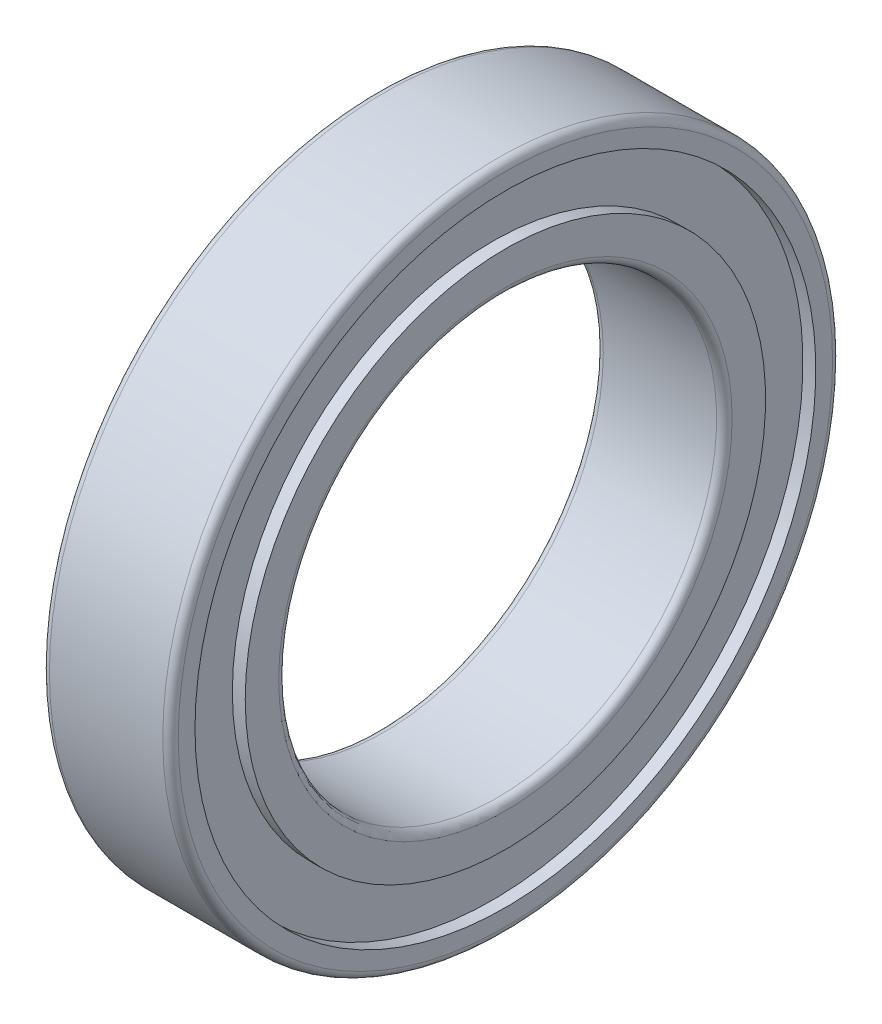
ISO-10303-21;
HEADER;
FILE_DESCRIPTION(('STEP AP214'),'2;1');
FILE_NAME('part.step','',(''),(''),'','','');
FILE_SCHEMA(('AUTOMOTIVE_DESIGN { 1 0 10303 214 1 1 1 1 }'));
ENDSEC;
DATA;
#1=APPLICATION_CONTEXT('core data for automotive mechanical design processes');
#2=APPLICATION_PROTOCOL_DEFINITION('international standard','automotive_design',2000,#1);
#3=PRODUCT_CONTEXT('',#1,'mechanical');
#4=PRODUCT('Part','Part','',(#3));
#5=PRODUCT_RELATED_PRODUCT_CATEGORY('part','',(#4));
#6=PRODUCT_DEFINITION_FORMATION('','',#4);
#7=PRODUCT_DEFINITION_CONTEXT('part definition',#1,'design');
#8=PRODUCT_DEFINITION('design','',#6,#7);
#9=PRODUCT_DEFINITION_SHAPE('','',#8);
#10=(LENGTH_UNIT() NAMED_UNIT(*) SI_UNIT(.MILLI.,.METRE.));
#11=(NAMED_UNIT(*) PLANE_ANGLE_UNIT() SI_UNIT($,.RADIAN.));
#12=(NAMED_UNIT(*) SI_UNIT($,.STERADIAN.) SOLID_ANGLE_UNIT());
#13=UNCERTAINTY_MEASURE_WITH_UNIT(LENGTH_MEASURE(1.E-05),#10,'distance_accuracy_value','');
#14=(GEOMETRIC_REPRESENTATION_CONTEXT(3) GLOBAL_UNCERTAINTY_ASSIGNED_CONTEXT((#13)) GLOBAL_UNIT_ASSIGNED_CONTEXT((#10,
#11,#12)) REPRESENTATION_CONTEXT('',''));
#15=CARTESIAN_POINT('',(0.,0.,0.));
#16=DIRECTION('',(0.,0.,1.));
#17=DIRECTION('',(1.,0.,0.));
#18=AXIS2_PLACEMENT_3D('',#15,#16,#17);
#19=CARTESIAN_POINT('',(0.,0.,0.));
#20=DIRECTION('',(-1.,0.,0.));
#21=DIRECTION('',(0.,0.,1.));
#22=AXIS2_PLACEMENT_3D('',#19,#20,#21);
#23=CYLINDRICAL_SURFACE('',#22,8.5);
#24=CARTESIAN_POINT('',(4.7,0.,0.));
#25=DIRECTION('',(-1.,0.,0.));
#26=DIRECTION('',(0.,0.,1.));
#27=AXIS2_PLACEMENT_3D('',#24,#25,#26);
#28=CIRCLE('',#27,8.5);
#29=CARTESIAN_POINT('',(4.7,0.,8.5));
#30=VERTEX_POINT('',#29);
#31=EDGE_CURVE('E258',#30,#30,#28,.T.);
#32=ORIENTED_EDGE('',*,*,#31,.F.);
#33=EDGE_LOOP('',(#32));
#34=FACE_BOUND('',#33,.T.);
#35=CARTESIAN_POINT('',(0.3,0.,0.));
#36=DIRECTION('',(1.,0.,0.));
#37=DIRECTION('',(0.,0.,-1.));
#38=AXIS2_PLACEMENT_3D('',#35,#36,#37);
#39=CIRCLE('',#38,8.5);
#40=CARTESIAN_POINT('',(0.3,0.,-8.5));
#41=VERTEX_POINT('',#40);
#42=EDGE_CURVE('E63',#41,#41,#39,.T.);
#43=ORIENTED_EDGE('',*,*,#42,.F.);
#44=EDGE_LOOP('',(#43));
#45=FACE_BOUND('',#44,.T.);
#46=ADVANCED_FACE('F16',(#34,#45),#23,.F.);
#47=CARTESIAN_POINT('',(4.7,0.,0.));
#48=DIRECTION('',(-1.,0.,0.));
#49=DIRECTION('',(0.,0.,1.));
#50=AXIS2_PLACEMENT_3D('',#47,#48,#49);
#51=TOROIDAL_SURFACE('',#50,8.8,0.3);
#52=CARTESIAN_POINT('',(5.,0.,0.));
#53=DIRECTION('',(1.,0.,0.));
#54=DIRECTION('',(0.,0.,1.));
#55=AXIS2_PLACEMENT_3D('',#52,#53,#54);
#56=CIRCLE('',#55,8.8);
#57=CARTESIAN_POINT('',(5.,0.,8.8));
#58=VERTEX_POINT('',#57);
#59=CARTESIAN_POINT('',(5.,0.,-8.8));
#60=VERTEX_POINT('',#59);
#61=EDGE_CURVE('E58',#58,#60,#56,.T.);
#62=ORIENTED_EDGE('',*,*,#61,.T.);
#63=CARTESIAN_POINT('',(5.,0.,0.));
#64=DIRECTION('',(1.,0.,0.));
#65=DIRECTION('',(0.,0.,-1.));
#66=AXIS2_PLACEMENT_3D('',#63,#64,#65);
#67=CIRCLE('',#66,8.8);
#68=EDGE_CURVE('E55',#60,#58,#67,.T.);
#69=ORIENTED_EDGE('',*,*,#68,.T.);
#70=EDGE_LOOP('',(#62,#69));
#71=FACE_BOUND('',#70,.T.);
#72=ORIENTED_EDGE('',*,*,#31,.T.);
#73=EDGE_LOOP('',(#72));
#74=FACE_BOUND('',#73,.T.);
#75=ADVANCED_FACE('F59',(#71,#74),#51,.T.);
#76=CARTESIAN_POINT('',(0.3,0.,0.));
#77=DIRECTION('',(1.,0.,0.));
#78=DIRECTION('',(0.,0.,-1.));
#79=AXIS2_PLACEMENT_3D('',#76,#77,#78);
#80=TOROIDAL_SURFACE('',#79,8.8,0.3);
#81=CARTESIAN_POINT('',(0.,0.,0.));
#82=DIRECTION('',(-1.,0.,0.));
#83=DIRECTION('',(0.,0.,-1.));
#84=AXIS2_PLACEMENT_3D('',#81,#82,#83);
#85=CIRCLE('',#84,8.8);
#86=CARTESIAN_POINT('',(0.,0.,-8.8));
#87=VERTEX_POINT('',#86);
#88=CARTESIAN_POINT('',(0.,0.,8.8));
#89=VERTEX_POINT('',#88);
#90=EDGE_CURVE('E67',#87,#89,#85,.T.);
#91=ORIENTED_EDGE('',*,*,#90,.T.);
#92=CARTESIAN_POINT('',(0.,0.,0.));
#93=DIRECTION('',(-1.,0.,0.));
#94=DIRECTION('',(0.,0.,1.));
#95=AXIS2_PLACEMENT_3D('',#92,#93,#94);
#96=CIRCLE('',#95,8.8);
#97=EDGE_CURVE('E221',#89,#87,#96,.T.);
#98=ORIENTED_EDGE('',*,*,#97,.T.);
#99=EDGE_LOOP('',(#91,#98));
#100=FACE_BOUND('',#99,.T.);
#101=ORIENTED_EDGE('',*,*,#42,.T.);
#102=EDGE_LOOP('',(#101));
#103=FACE_BOUND('',#102,.T.);
#104=ADVANCED_FACE('F88',(#100,#103),#80,.T.);
#105=CARTESIAN_POINT('',(5.,8.5,0.));
#106=DIRECTION('',(-1.,0.,0.));
#107=DIRECTION('',(0.,0.,1.));
#108=AXIS2_PLACEMENT_3D('',#105,#106,#107);
#109=PLANE('',#108);
#110=CARTESIAN_POINT('',(5.,0.,0.));
#111=DIRECTION('',(-1.,0.,0.));
#112=DIRECTION('',(0.,0.,1.));
#113=AXIS2_PLACEMENT_3D('',#110,#111,#112);
#114=CIRCLE('',#113,10.1);
#115=CARTESIAN_POINT('',(5.,0.,10.1));
#116=VERTEX_POINT('',#115);
#117=EDGE_CURVE('E229',#116,#116,#114,.T.);
#118=ORIENTED_EDGE('',*,*,#117,.F.);
#119=EDGE_LOOP('',(#118));
#120=FACE_BOUND('',#119,.T.);
#121=ORIENTED_EDGE('',*,*,#61,.F.);
#122=ORIENTED_EDGE('',*,*,#68,.F.);
#123=EDGE_LOOP('',(#121,#122));
#124=FACE_BOUND('',#123,.T.);
#125=ADVANCED_FACE('F66',(#120,#124),#109,.F.);
#126=CARTESIAN_POINT('',(0.,8.5,0.));
#127=DIRECTION('',(1.,0.,0.));
#128=DIRECTION('',(0.,0.,-1.));
#129=AXIS2_PLACEMENT_3D('',#126,#127,#128);
#130=PLANE('',#129);
#131=CARTESIAN_POINT('',(0.,0.,0.));
#132=DIRECTION('',(-1.,0.,0.));
#133=DIRECTION('',(0.,0.,1.));
#134=AXIS2_PLACEMENT_3D('',#131,#132,#133);
#135=CIRCLE('',#134,10.1);
#136=CARTESIAN_POINT('',(0.,0.,10.1));
#137=VERTEX_POINT('',#136);
#138=EDGE_CURVE('E231',#137,#137,#135,.F.);
#139=ORIENTED_EDGE('',*,*,#138,.F.);
#140=EDGE_LOOP('',(#139));
#141=FACE_BOUND('',#140,.T.);
#142=ORIENTED_EDGE('',*,*,#90,.F.);
#143=ORIENTED_EDGE('',*,*,#97,.F.);
#144=EDGE_LOOP('',(#142,#143));
#145=FACE_BOUND('',#144,.T.);
#146=ADVANCED_FACE('F87',(#141,#145),#130,.F.);
#147=CARTESIAN_POINT('',(0.,0.,0.));
#148=DIRECTION('',(-1.,0.,0.));
#149=DIRECTION('',(0.,0.,1.));
#150=AXIS2_PLACEMENT_3D('',#147,#148,#149);
#151=CYLINDRICAL_SURFACE('',#150,10.1);
#152=CARTESIAN_POINT('',(4.5,0.,0.));
#153=DIRECTION('',(-1.,0.,0.));
#154=DIRECTION('',(0.,0.,1.));
#155=AXIS2_PLACEMENT_3D('',#152,#153,#154);
#156=CIRCLE('',#155,10.1);
#157=CARTESIAN_POINT('',(4.5,0.,10.1));
#158=VERTEX_POINT('',#157);
#159=EDGE_CURVE('E236',#158,#158,#156,.F.);
#160=ORIENTED_EDGE('',*,*,#159,.T.);
#161=EDGE_LOOP('',(#160));
#162=FACE_BOUND('',#161,.T.);
#163=ORIENTED_EDGE('',*,*,#117,.T.);
#164=EDGE_LOOP('',(#163));
#165=FACE_BOUND('',#164,.T.);
#166=ADVANCED_FACE('F271',(#162,#165),#151,.T.);
#167=CARTESIAN_POINT('',(0.,0.,0.));
#168=DIRECTION('',(-1.,0.,0.));
#169=DIRECTION('',(0.,0.,1.));
#170=AXIS2_PLACEMENT_3D('',#167,#168,#169);
#171=CYLINDRICAL_SURFACE('',#170,10.1);
#172=ORIENTED_EDGE('',*,*,#138,.T.);
#173=EDGE_LOOP('',(#172));
#174=FACE_BOUND('',#173,.T.);
#175=CARTESIAN_POINT('',(0.5,0.,0.));
#176=DIRECTION('',(-1.,0.,0.));
#177=DIRECTION('',(0.,0.,1.));
#178=AXIS2_PLACEMENT_3D('',#175,#176,#177);
#179=CIRCLE('',#178,10.1);
#180=CARTESIAN_POINT('',(0.5,0.,10.1));
#181=VERTEX_POINT('',#180);
#182=EDGE_CURVE('E266',#181,#181,#179,.T.);
#183=ORIENTED_EDGE('',*,*,#182,.T.);
#184=EDGE_LOOP('',(#183));
#185=FACE_BOUND('',#184,.T.);
#186=ADVANCED_FACE('F277',(#174,#185),#171,.T.);
#187=CARTESIAN_POINT('',(4.5,12.05,0.));
#188=DIRECTION('',(-1.,0.,0.));
#189=DIRECTION('',(0.,0.,1.));
#190=AXIS2_PLACEMENT_3D('',#187,#188,#189);
#191=PLANE('',#190);
#192=ORIENTED_EDGE('',*,*,#159,.F.);
#193=EDGE_LOOP('',(#192));
#194=FACE_BOUND('',#193,.T.);
#195=CARTESIAN_POINT('',(4.5,0.,0.));
#196=DIRECTION('',(-1.,0.,0.));
#197=DIRECTION('',(0.,0.,1.));
#198=AXIS2_PLACEMENT_3D('',#195,#196,#197);
#199=CIRCLE('',#198,12.05);
#200=CARTESIAN_POINT('',(4.5,0.,12.05));
#201=VERTEX_POINT('',#200);
#202=EDGE_CURVE('E263',#201,#201,#199,.F.);
#203=ORIENTED_EDGE('',*,*,#202,.T.);
#204=EDGE_LOOP('',(#203));
#205=FACE_BOUND('',#204,.T.);
#206=ADVANCED_FACE('F273',(#194,#205),#191,.F.);
#207=CARTESIAN_POINT('',(0.5,10.1,0.));
#208=DIRECTION('',(1.,0.,0.));
#209=DIRECTION('',(0.,0.,-1.));
#210=AXIS2_PLACEMENT_3D('',#207,#208,#209);
#211=PLANE('',#210);
#212=CARTESIAN_POINT('',(0.5,0.,0.));
#213=DIRECTION('',(-1.,0.,0.));
#214=DIRECTION('',(0.,0.,1.));
#215=AXIS2_PLACEMENT_3D('',#212,#213,#214);
#216=CIRCLE('',#215,12.05);
#217=CARTESIAN_POINT('',(0.5,0.,12.05));
#218=VERTEX_POINT('',#217);
#219=EDGE_CURVE('E255',#218,#218,#216,.T.);
#220=ORIENTED_EDGE('',*,*,#219,.T.);
#221=EDGE_LOOP('',(#220));
#222=FACE_BOUND('',#221,.T.);
#223=ORIENTED_EDGE('',*,*,#182,.F.);
#224=EDGE_LOOP('',(#223));
#225=FACE_BOUND('',#224,.T.);
#226=ADVANCED_FACE('F276',(#222,#225),#211,.F.);
#227=CARTESIAN_POINT('',(0.,0.,0.));
#228=DIRECTION('',(-1.,0.,0.));
#229=DIRECTION('',(0.,0.,1.));
#230=AXIS2_PLACEMENT_3D('',#227,#228,#229);
#231=CYLINDRICAL_SURFACE('',#230,12.05);
#232=CARTESIAN_POINT('',(5.,0.,0.));
#233=DIRECTION('',(-1.,0.,0.));
#234=DIRECTION('',(0.,0.,1.));
#235=AXIS2_PLACEMENT_3D('',#232,#233,#234);
#236=CIRCLE('',#235,12.05);
#237=CARTESIAN_POINT('',(5.,0.,12.05));
#238=VERTEX_POINT('',#237);
#239=EDGE_CURVE('E250',#238,#238,#236,.F.);
#240=ORIENTED_EDGE('',*,*,#239,.T.);
#241=EDGE_LOOP('',(#240));
#242=FACE_BOUND('',#241,.T.);
#243=ORIENTED_EDGE('',*,*,#202,.F.);
#244=EDGE_LOOP('',(#243));
#245=FACE_BOUND('',#244,.T.);
#246=ADVANCED_FACE('F281',(#242,#245),#231,.F.);
#247=CARTESIAN_POINT('',(0.,0.,0.));
#248=DIRECTION('',(-1.,0.,0.));
#249=DIRECTION('',(0.,0.,1.));
#250=AXIS2_PLACEMENT_3D('',#247,#248,#249);
#251=CYLINDRICAL_SURFACE('',#250,12.05);
#252=ORIENTED_EDGE('',*,*,#219,.F.);
#253=EDGE_LOOP('',(#252));
#254=FACE_BOUND('',#253,.T.);
#255=CARTESIAN_POINT('',(0.,0.,0.));
#256=DIRECTION('',(-1.,0.,0.));
#257=DIRECTION('',(0.,0.,1.));
#258=AXIS2_PLACEMENT_3D('',#255,#256,#257);
#259=CIRCLE('',#258,12.05);
#260=CARTESIAN_POINT('',(0.,0.,12.05));
#261=VERTEX_POINT('',#260);
#262=EDGE_CURVE('E248',#261,#261,#259,.T.);
#263=ORIENTED_EDGE('',*,*,#262,.T.);
#264=EDGE_LOOP('',(#263));
#265=FACE_BOUND('',#264,.T.);
#266=ADVANCED_FACE('F189',(#254,#265),#251,.F.);
#267=CARTESIAN_POINT('',(5.,13.,0.));
#268=DIRECTION('',(-1.,0.,0.));
#269=DIRECTION('',(0.,0.,1.));
#270=AXIS2_PLACEMENT_3D('',#267,#268,#269);
#271=PLANE('',#270);
#272=ORIENTED_EDGE('',*,*,#239,.F.);
#273=EDGE_LOOP('',(#272));
#274=FACE_BOUND('',#273,.T.);
#275=CARTESIAN_POINT('',(5.,0.,0.));
#276=DIRECTION('',(-1.,0.,0.));
#277=DIRECTION('',(0.,0.,1.));
#278=AXIS2_PLACEMENT_3D('',#275,#276,#277);
#279=CIRCLE('',#278,12.7);
#280=CARTESIAN_POINT('',(5.,0.,12.7));
#281=VERTEX_POINT('',#280);
#282=CARTESIAN_POINT('',(5.,0.,-12.7));
#283=VERTEX_POINT('',#282);
#284=EDGE_CURVE('E175',#281,#283,#279,.T.);
#285=ORIENTED_EDGE('',*,*,#284,.F.);
#286=CARTESIAN_POINT('',(5.,0.,0.));
#287=DIRECTION('',(-1.,0.,0.));
#288=DIRECTION('',(0.,0.,-1.));
#289=AXIS2_PLACEMENT_3D('',#286,#287,#288);
#290=CIRCLE('',#289,12.7);
#291=EDGE_CURVE('E247',#283,#281,#290,.T.);
#292=ORIENTED_EDGE('',*,*,#291,.F.);
#293=EDGE_LOOP('',(#285,#292));
#294=FACE_BOUND('',#293,.T.);
#295=ADVANCED_FACE('F180',(#274,#294),#271,.F.);
#296=CARTESIAN_POINT('',(0.,12.05,0.));
#297=DIRECTION('',(1.,0.,0.));
#298=DIRECTION('',(0.,0.,-1.));
#299=AXIS2_PLACEMENT_3D('',#296,#297,#298);
#300=PLANE('',#299);
#301=ORIENTED_EDGE('',*,*,#262,.F.);
#302=EDGE_LOOP('',(#301));
#303=FACE_BOUND('',#302,.T.);
#304=CARTESIAN_POINT('',(0.,0.,0.));
#305=DIRECTION('',(1.,0.,0.));
#306=DIRECTION('',(0.,0.,-1.));
#307=AXIS2_PLACEMENT_3D('',#304,#305,#306);
#308=CIRCLE('',#307,12.7);
#309=CARTESIAN_POINT('',(0.,0.,-12.7));
#310=VERTEX_POINT('',#309);
#311=CARTESIAN_POINT('',(0.,0.,12.7));
#312=VERTEX_POINT('',#311);
#313=EDGE_CURVE('E145',#310,#312,#308,.T.);
#314=ORIENTED_EDGE('',*,*,#313,.F.);
#315=CARTESIAN_POINT('',(0.,0.,0.));
#316=DIRECTION('',(1.,0.,0.));
#317=DIRECTION('',(0.,0.,1.));
#318=AXIS2_PLACEMENT_3D('',#315,#316,#317);
#319=CIRCLE('',#318,12.7);
#320=EDGE_CURVE('E34',#312,#310,#319,.T.);
#321=ORIENTED_EDGE('',*,*,#320,.F.);
#322=EDGE_LOOP('',(#314,#321));
#323=FACE_BOUND('',#322,.T.);
#324=ADVANCED_FACE('F131',(#303,#323),#300,.F.);
#325=CARTESIAN_POINT('',(4.7,0.,0.));
#326=DIRECTION('',(-1.,0.,0.));
#327=DIRECTION('',(0.,0.,1.));
#328=AXIS2_PLACEMENT_3D('',#325,#326,#327);
#329=TOROIDAL_SURFACE('',#328,12.7,0.3);
#330=CARTESIAN_POINT('',(4.7,0.,0.));
#331=DIRECTION('',(-1.,0.,0.));
#332=DIRECTION('',(0.,0.,1.));
#333=AXIS2_PLACEMENT_3D('',#330,#331,#332);
#334=CIRCLE('',#333,13.);
#335=CARTESIAN_POINT('',(4.7,0.,13.));
#336=VERTEX_POINT('',#335);
#337=EDGE_CURVE('E26',#336,#336,#334,.T.);
#338=ORIENTED_EDGE('',*,*,#337,.F.);
#339=EDGE_LOOP('',(#338));
#340=FACE_BOUND('',#339,.T.);
#341=ORIENTED_EDGE('',*,*,#284,.T.);
#342=ORIENTED_EDGE('',*,*,#291,.T.);
#343=EDGE_LOOP('',(#341,#342));
#344=FACE_BOUND('',#343,.T.);
#345=ADVANCED_FACE('F119',(#340,#344),#329,.T.);
#346=CARTESIAN_POINT('',(0.3,0.,0.));
#347=DIRECTION('',(1.,0.,0.));
#348=DIRECTION('',(0.,0.,-1.));
#349=AXIS2_PLACEMENT_3D('',#346,#347,#348);
#350=TOROIDAL_SURFACE('',#349,12.7,0.3);
#351=CARTESIAN_POINT('',(0.3,0.,0.));
#352=DIRECTION('',(-1.,0.,0.));
#353=DIRECTION('',(0.,0.,1.));
#354=AXIS2_PLACEMENT_3D('',#351,#352,#353);
#355=CIRCLE('',#354,13.);
#356=CARTESIAN_POINT('',(0.3,0.,13.));
#357=VERTEX_POINT('',#356);
#358=EDGE_CURVE('E11',#357,#357,#355,.F.);
#359=ORIENTED_EDGE('',*,*,#358,.F.);
#360=EDGE_LOOP('',(#359));
#361=FACE_BOUND('',#360,.T.);
#362=ORIENTED_EDGE('',*,*,#313,.T.);
#363=ORIENTED_EDGE('',*,*,#320,.T.);
#364=EDGE_LOOP('',(#362,#363));
#365=FACE_BOUND('',#364,.T.);
#366=ADVANCED_FACE('F130',(#361,#365),#350,.T.);
#367=CARTESIAN_POINT('',(0.,0.,0.));
#368=DIRECTION('',(-1.,0.,0.));
#369=DIRECTION('',(0.,0.,1.));
#370=AXIS2_PLACEMENT_3D('',#367,#368,#369);
#371=CYLINDRICAL_SURFACE('',#370,13.);
#372=ORIENTED_EDGE('',*,*,#358,.T.);
#373=EDGE_LOOP('',(#372));
#374=FACE_BOUND('',#373,.T.);
#375=ORIENTED_EDGE('',*,*,#337,.T.);
#376=EDGE_LOOP('',(#375));
#377=FACE_BOUND('',#376,.T.);
#378=ADVANCED_FACE('F292',(#374,#377),#371,.T.);
#379=CLOSED_SHELL('',(#46,#75,#104,#125,#146,#166,#186,#206,#226,#246,#266,#295,#324,#345,#366,#378));
#380=MANIFOLD_SOLID_BREP('B1',#379);
#381=ADVANCED_BREP_SHAPE_REPRESENTATION('',(#18,#380),#14);
#382=SHAPE_DEFINITION_REPRESENTATION(#9,#381);
ENDSEC;
END-ISO-10303-21;
